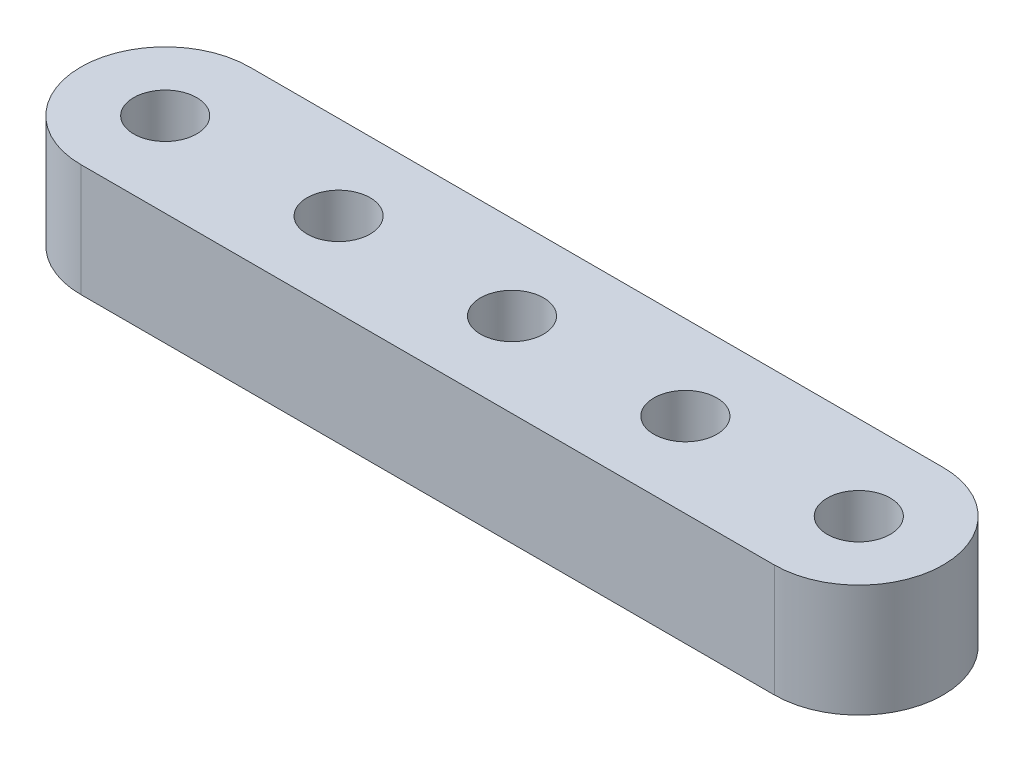
ISO-10303-21;
HEADER;
FILE_DESCRIPTION(('STEP AP214'),'2;1');
FILE_NAME('part.step','',(''),(''),'','','');
FILE_SCHEMA(('AUTOMOTIVE_DESIGN { 1 0 10303 214 1 1 1 1 }'));
ENDSEC;
DATA;
#1=APPLICATION_CONTEXT('core data for automotive mechanical design processes');
#2=APPLICATION_PROTOCOL_DEFINITION('international standard','automotive_design',2000,#1);
#3=PRODUCT_CONTEXT('',#1,'mechanical');
#4=PRODUCT('Part','Part','',(#3));
#5=PRODUCT_RELATED_PRODUCT_CATEGORY('part','',(#4));
#6=PRODUCT_DEFINITION_FORMATION('','',#4);
#7=PRODUCT_DEFINITION_CONTEXT('part definition',#1,'design');
#8=PRODUCT_DEFINITION('design','',#6,#7);
#9=PRODUCT_DEFINITION_SHAPE('','',#8);
#10=(LENGTH_UNIT() NAMED_UNIT(*) SI_UNIT(.MILLI.,.METRE.));
#11=(NAMED_UNIT(*) PLANE_ANGLE_UNIT() SI_UNIT($,.RADIAN.));
#12=(NAMED_UNIT(*) SI_UNIT($,.STERADIAN.) SOLID_ANGLE_UNIT());
#13=UNCERTAINTY_MEASURE_WITH_UNIT(LENGTH_MEASURE(1.E-05),#10,'distance_accuracy_value','');
#14=(GEOMETRIC_REPRESENTATION_CONTEXT(3) GLOBAL_UNCERTAINTY_ASSIGNED_CONTEXT((#13)) GLOBAL_UNIT_ASSIGNED_CONTEXT((#10,
#11,#12)) REPRESENTATION_CONTEXT('',''));
#15=CARTESIAN_POINT('',(0.,0.,0.));
#16=DIRECTION('',(0.,0.,1.));
#17=DIRECTION('',(1.,0.,0.));
#18=AXIS2_PLACEMENT_3D('',#15,#16,#17);
#19=CARTESIAN_POINT('',(19.558,0.,0.));
#20=DIRECTION('',(0.,1.,0.));
#21=DIRECTION('',(0.,0.,1.));
#22=AXIS2_PLACEMENT_3D('',#19,#20,#21);
#23=CYLINDRICAL_SURFACE('',#22,4.7625);
#24=CARTESIAN_POINT('',(19.558,6.35,0.));
#25=DIRECTION('',(0.,1.,0.));
#26=DIRECTION('',(0.,0.,1.));
#27=AXIS2_PLACEMENT_3D('',#24,#25,#26);
#28=CIRCLE('',#27,4.7625);
#29=CARTESIAN_POINT('',(19.558,6.35,4.76250000000001));
#30=VERTEX_POINT('',#29);
#31=CARTESIAN_POINT('',(19.558,6.35,-4.7625));
#32=VERTEX_POINT('',#31);
#33=EDGE_CURVE('E98',#30,#32,#28,.T.);
#34=ORIENTED_EDGE('',*,*,#33,.F.);
#35=DIRECTION('',(0.,1.,0.));
#36=VECTOR('',#35,1.);
#37=CARTESIAN_POINT('',(19.558,0.,4.76250000000001));
#38=LINE('',#37,#36);
#39=CARTESIAN_POINT('',(19.558,0.,4.76250000000001));
#40=VERTEX_POINT('',#39);
#41=EDGE_CURVE('E11',#40,#30,#38,.T.);
#42=ORIENTED_EDGE('',*,*,#41,.F.);
#43=CARTESIAN_POINT('',(19.558,0.,0.));
#44=DIRECTION('',(0.,1.,0.));
#45=DIRECTION('',(0.,0.,1.));
#46=AXIS2_PLACEMENT_3D('',#43,#44,#45);
#47=CIRCLE('',#46,4.7625);
#48=CARTESIAN_POINT('',(19.558,0.,-4.7625));
#49=VERTEX_POINT('',#48);
#50=EDGE_CURVE('E91',#40,#49,#47,.T.);
#51=ORIENTED_EDGE('',*,*,#50,.T.);
#52=DIRECTION('',(0.,1.,0.));
#53=VECTOR('',#52,1.);
#54=CARTESIAN_POINT('',(19.558,0.,-4.7625));
#55=LINE('',#54,#53);
#56=EDGE_CURVE('E36',#49,#32,#55,.T.);
#57=ORIENTED_EDGE('',*,*,#56,.T.);
#58=EDGE_LOOP('',(#34,#42,#51,#57));
#59=FACE_BOUND('',#58,.T.);
#60=ADVANCED_FACE('F33',(#59),#23,.T.);
#61=CARTESIAN_POINT('',(-19.558,0.,4.76250000000001));
#62=DIRECTION('',(0.,0.,1.));
#63=DIRECTION('',(1.,0.,0.));
#64=AXIS2_PLACEMENT_3D('',#61,#62,#63);
#65=PLANE('',#64);
#66=DIRECTION('',(1.,0.,0.));
#67=VECTOR('',#66,1.);
#68=CARTESIAN_POINT('',(-19.558,6.35,4.76250000000001));
#69=LINE('',#68,#67);
#70=CARTESIAN_POINT('',(-19.558,6.35,4.76250000000001));
#71=VERTEX_POINT('',#70);
#72=EDGE_CURVE('E93',#71,#30,#69,.T.);
#73=ORIENTED_EDGE('',*,*,#72,.F.);
#74=DIRECTION('',(0.,1.,0.));
#75=VECTOR('',#74,1.);
#76=CARTESIAN_POINT('',(-19.558,0.,4.76250000000001));
#77=LINE('',#76,#75);
#78=CARTESIAN_POINT('',(-19.558,0.,4.76250000000001));
#79=VERTEX_POINT('',#78);
#80=EDGE_CURVE('E42',#79,#71,#77,.T.);
#81=ORIENTED_EDGE('',*,*,#80,.F.);
#82=DIRECTION('',(1.,0.,0.));
#83=VECTOR('',#82,1.);
#84=CARTESIAN_POINT('',(-19.558,0.,4.76250000000001));
#85=LINE('',#84,#83);
#86=EDGE_CURVE('E88',#79,#40,#85,.T.);
#87=ORIENTED_EDGE('',*,*,#86,.T.);
#88=ORIENTED_EDGE('',*,*,#41,.T.);
#89=EDGE_LOOP('',(#73,#81,#87,#88));
#90=FACE_BOUND('',#89,.T.);
#91=ADVANCED_FACE('F109',(#90),#65,.T.);
#92=CARTESIAN_POINT('',(-19.558,0.,0.));
#93=DIRECTION('',(0.,1.,0.));
#94=DIRECTION('',(0.,0.,1.));
#95=AXIS2_PLACEMENT_3D('',#92,#93,#94);
#96=CYLINDRICAL_SURFACE('',#95,4.7625);
#97=CARTESIAN_POINT('',(-19.558,6.35,0.));
#98=DIRECTION('',(0.,1.,0.));
#99=DIRECTION('',(0.,0.,1.));
#100=AXIS2_PLACEMENT_3D('',#97,#98,#99);
#101=CIRCLE('',#100,4.7625);
#102=CARTESIAN_POINT('',(-19.558,6.35,-4.7625));
#103=VERTEX_POINT('',#102);
#104=EDGE_CURVE('E83',#103,#71,#101,.T.);
#105=ORIENTED_EDGE('',*,*,#104,.F.);
#106=DIRECTION('',(0.,1.,0.));
#107=VECTOR('',#106,1.);
#108=CARTESIAN_POINT('',(-19.558,0.,-4.7625));
#109=LINE('',#108,#107);
#110=CARTESIAN_POINT('',(-19.558,0.,-4.7625));
#111=VERTEX_POINT('',#110);
#112=EDGE_CURVE('E78',#111,#103,#109,.T.);
#113=ORIENTED_EDGE('',*,*,#112,.F.);
#114=CARTESIAN_POINT('',(-19.558,0.,0.));
#115=DIRECTION('',(0.,1.,0.));
#116=DIRECTION('',(0.,0.,1.));
#117=AXIS2_PLACEMENT_3D('',#114,#115,#116);
#118=CIRCLE('',#117,4.7625);
#119=EDGE_CURVE('E81',#111,#79,#118,.T.);
#120=ORIENTED_EDGE('',*,*,#119,.T.);
#121=ORIENTED_EDGE('',*,*,#80,.T.);
#122=EDGE_LOOP('',(#105,#113,#120,#121));
#123=FACE_BOUND('',#122,.T.);
#124=ADVANCED_FACE('F80',(#123),#96,.T.);
#125=CARTESIAN_POINT('',(19.558,0.,-4.7625));
#126=DIRECTION('',(0.,0.,-1.));
#127=DIRECTION('',(-1.,0.,0.));
#128=AXIS2_PLACEMENT_3D('',#125,#126,#127);
#129=PLANE('',#128);
#130=DIRECTION('',(-1.,0.,0.));
#131=VECTOR('',#130,1.);
#132=CARTESIAN_POINT('',(19.558,6.35,-4.7625));
#133=LINE('',#132,#131);
#134=EDGE_CURVE('E101',#32,#103,#133,.T.);
#135=ORIENTED_EDGE('',*,*,#134,.F.);
#136=ORIENTED_EDGE('',*,*,#56,.F.);
#137=DIRECTION('',(-1.,0.,0.));
#138=VECTOR('',#137,1.);
#139=CARTESIAN_POINT('',(19.558,0.,-4.7625));
#140=LINE('',#139,#138);
#141=EDGE_CURVE('E87',#49,#111,#140,.T.);
#142=ORIENTED_EDGE('',*,*,#141,.T.);
#143=ORIENTED_EDGE('',*,*,#112,.T.);
#144=EDGE_LOOP('',(#135,#136,#142,#143));
#145=FACE_BOUND('',#144,.T.);
#146=ADVANCED_FACE('F90',(#145),#129,.T.);
#147=CARTESIAN_POINT('',(19.558,0.,0.));
#148=DIRECTION('',(0.,1.,0.));
#149=DIRECTION('',(0.,0.,1.));
#150=AXIS2_PLACEMENT_3D('',#147,#148,#149);
#151=PLANE('',#150);
#152=CARTESIAN_POINT('',(-19.558,0.,0.));
#153=DIRECTION('',(0.,1.,0.));
#154=DIRECTION('',(0.,0.,-1.));
#155=AXIS2_PLACEMENT_3D('',#152,#153,#154);
#156=CIRCLE('',#155,1.77799999999998);
#157=CARTESIAN_POINT('',(-19.558,0.,-1.77799999999998));
#158=VERTEX_POINT('',#157);
#159=EDGE_CURVE('E154',#158,#158,#156,.T.);
#160=ORIENTED_EDGE('',*,*,#159,.T.);
#161=EDGE_LOOP('',(#160));
#162=FACE_BOUND('',#161,.T.);
#163=CARTESIAN_POINT('',(-9.779,0.,0.));
#164=DIRECTION('',(0.,1.,0.));
#165=DIRECTION('',(0.,0.,-1.));
#166=AXIS2_PLACEMENT_3D('',#163,#164,#165);
#167=CIRCLE('',#166,1.77799999999999);
#168=CARTESIAN_POINT('',(-9.779,0.,-1.77799999999999));
#169=VERTEX_POINT('',#168);
#170=EDGE_CURVE('E162',#169,#169,#167,.T.);
#171=ORIENTED_EDGE('',*,*,#170,.T.);
#172=EDGE_LOOP('',(#171));
#173=FACE_BOUND('',#172,.T.);
#174=CARTESIAN_POINT('',(0.,0.,0.));
#175=DIRECTION('',(0.,1.,0.));
#176=DIRECTION('',(0.,0.,-1.));
#177=AXIS2_PLACEMENT_3D('',#174,#175,#176);
#178=CIRCLE('',#177,1.77799999999999);
#179=CARTESIAN_POINT('',(0.,0.,-1.77799999999999));
#180=VERTEX_POINT('',#179);
#181=EDGE_CURVE('E168',#180,#180,#178,.T.);
#182=ORIENTED_EDGE('',*,*,#181,.T.);
#183=EDGE_LOOP('',(#182));
#184=FACE_BOUND('',#183,.T.);
#185=CARTESIAN_POINT('',(9.779,0.,0.));
#186=DIRECTION('',(0.,1.,0.));
#187=DIRECTION('',(0.,0.,-1.));
#188=AXIS2_PLACEMENT_3D('',#185,#186,#187);
#189=CIRCLE('',#188,1.77799999999999);
#190=CARTESIAN_POINT('',(9.779,0.,-1.77799999999998));
#191=VERTEX_POINT('',#190);
#192=EDGE_CURVE('E174',#191,#191,#189,.T.);
#193=ORIENTED_EDGE('',*,*,#192,.T.);
#194=EDGE_LOOP('',(#193));
#195=FACE_BOUND('',#194,.T.);
#196=CARTESIAN_POINT('',(19.558,0.,0.));
#197=DIRECTION('',(0.,1.,0.));
#198=DIRECTION('',(0.,0.,-1.));
#199=AXIS2_PLACEMENT_3D('',#196,#197,#198);
#200=CIRCLE('',#199,1.77799999999999);
#201=CARTESIAN_POINT('',(19.558,0.,-1.77799999999998));
#202=VERTEX_POINT('',#201);
#203=EDGE_CURVE('E102',#202,#202,#200,.T.);
#204=ORIENTED_EDGE('',*,*,#203,.T.);
#205=EDGE_LOOP('',(#204));
#206=FACE_BOUND('',#205,.T.);
#207=ORIENTED_EDGE('',*,*,#50,.F.);
#208=ORIENTED_EDGE('',*,*,#86,.F.);
#209=ORIENTED_EDGE('',*,*,#119,.F.);
#210=ORIENTED_EDGE('',*,*,#141,.F.);
#211=EDGE_LOOP('',(#207,#208,#209,#210));
#212=FACE_BOUND('',#211,.T.);
#213=ADVANCED_FACE('F86',(#162,#173,#184,#195,#206,#212),#151,.F.);
#214=CARTESIAN_POINT('',(19.558,6.35,0.));
#215=DIRECTION('',(0.,1.,0.));
#216=DIRECTION('',(0.,0.,1.));
#217=AXIS2_PLACEMENT_3D('',#214,#215,#216);
#218=PLANE('',#217);
#219=CARTESIAN_POINT('',(-19.558,6.35,0.));
#220=DIRECTION('',(0.,1.,0.));
#221=DIRECTION('',(0.,0.,-1.));
#222=AXIS2_PLACEMENT_3D('',#219,#220,#221);
#223=CIRCLE('',#222,1.77799999999998);
#224=CARTESIAN_POINT('',(-19.558,6.35,-1.77799999999998));
#225=VERTEX_POINT('',#224);
#226=EDGE_CURVE('E157',#225,#225,#223,.T.);
#227=ORIENTED_EDGE('',*,*,#226,.F.);
#228=EDGE_LOOP('',(#227));
#229=FACE_BOUND('',#228,.T.);
#230=CARTESIAN_POINT('',(-9.779,6.35,0.));
#231=DIRECTION('',(0.,1.,0.));
#232=DIRECTION('',(0.,0.,-1.));
#233=AXIS2_PLACEMENT_3D('',#230,#231,#232);
#234=CIRCLE('',#233,1.77799999999999);
#235=CARTESIAN_POINT('',(-9.779,6.35,-1.77799999999999));
#236=VERTEX_POINT('',#235);
#237=EDGE_CURVE('E159',#236,#236,#234,.T.);
#238=ORIENTED_EDGE('',*,*,#237,.F.);
#239=EDGE_LOOP('',(#238));
#240=FACE_BOUND('',#239,.T.);
#241=CARTESIAN_POINT('',(0.,6.35,0.));
#242=DIRECTION('',(0.,1.,0.));
#243=DIRECTION('',(0.,0.,-1.));
#244=AXIS2_PLACEMENT_3D('',#241,#242,#243);
#245=CIRCLE('',#244,1.77799999999999);
#246=CARTESIAN_POINT('',(0.,6.35,-1.77799999999999));
#247=VERTEX_POINT('',#246);
#248=EDGE_CURVE('E165',#247,#247,#245,.T.);
#249=ORIENTED_EDGE('',*,*,#248,.F.);
#250=EDGE_LOOP('',(#249));
#251=FACE_BOUND('',#250,.T.);
#252=CARTESIAN_POINT('',(9.779,6.35,0.));
#253=DIRECTION('',(0.,1.,0.));
#254=DIRECTION('',(0.,0.,-1.));
#255=AXIS2_PLACEMENT_3D('',#252,#253,#254);
#256=CIRCLE('',#255,1.77799999999999);
#257=CARTESIAN_POINT('',(9.779,6.35,-1.77799999999998));
#258=VERTEX_POINT('',#257);
#259=EDGE_CURVE('E171',#258,#258,#256,.T.);
#260=ORIENTED_EDGE('',*,*,#259,.F.);
#261=EDGE_LOOP('',(#260));
#262=FACE_BOUND('',#261,.T.);
#263=CARTESIAN_POINT('',(19.558,6.35,0.));
#264=DIRECTION('',(0.,1.,0.));
#265=DIRECTION('',(0.,0.,-1.));
#266=AXIS2_PLACEMENT_3D('',#263,#264,#265);
#267=CIRCLE('',#266,1.77799999999999);
#268=CARTESIAN_POINT('',(19.558,6.35,-1.77799999999998));
#269=VERTEX_POINT('',#268);
#270=EDGE_CURVE('E177',#269,#269,#267,.T.);
#271=ORIENTED_EDGE('',*,*,#270,.F.);
#272=EDGE_LOOP('',(#271));
#273=FACE_BOUND('',#272,.T.);
#274=ORIENTED_EDGE('',*,*,#33,.T.);
#275=ORIENTED_EDGE('',*,*,#134,.T.);
#276=ORIENTED_EDGE('',*,*,#104,.T.);
#277=ORIENTED_EDGE('',*,*,#72,.T.);
#278=EDGE_LOOP('',(#274,#275,#276,#277));
#279=FACE_BOUND('',#278,.T.);
#280=ADVANCED_FACE('F108',(#229,#240,#251,#262,#273,#279),#218,.T.);
#281=CARTESIAN_POINT('',(19.558,0.,0.));
#282=DIRECTION('',(0.,1.,0.));
#283=DIRECTION('',(0.,0.,1.));
#284=AXIS2_PLACEMENT_3D('',#281,#282,#283);
#285=CYLINDRICAL_SURFACE('',#284,1.77799999999999);
#286=ORIENTED_EDGE('',*,*,#203,.F.);
#287=EDGE_LOOP('',(#286));
#288=FACE_BOUND('',#287,.T.);
#289=ORIENTED_EDGE('',*,*,#270,.T.);
#290=EDGE_LOOP('',(#289));
#291=FACE_BOUND('',#290,.T.);
#292=ADVANCED_FACE('F127',(#288,#291),#285,.F.);
#293=CARTESIAN_POINT('',(9.779,0.,0.));
#294=DIRECTION('',(0.,1.,0.));
#295=DIRECTION('',(0.,0.,1.));
#296=AXIS2_PLACEMENT_3D('',#293,#294,#295);
#297=CYLINDRICAL_SURFACE('',#296,1.77799999999999);
#298=ORIENTED_EDGE('',*,*,#192,.F.);
#299=EDGE_LOOP('',(#298));
#300=FACE_BOUND('',#299,.T.);
#301=ORIENTED_EDGE('',*,*,#259,.T.);
#302=EDGE_LOOP('',(#301));
#303=FACE_BOUND('',#302,.T.);
#304=ADVANCED_FACE('F134',(#300,#303),#297,.F.);
#305=CARTESIAN_POINT('',(0.,0.,0.));
#306=DIRECTION('',(0.,1.,0.));
#307=DIRECTION('',(0.,0.,1.));
#308=AXIS2_PLACEMENT_3D('',#305,#306,#307);
#309=CYLINDRICAL_SURFACE('',#308,1.77799999999999);
#310=ORIENTED_EDGE('',*,*,#181,.F.);
#311=EDGE_LOOP('',(#310));
#312=FACE_BOUND('',#311,.T.);
#313=ORIENTED_EDGE('',*,*,#248,.T.);
#314=EDGE_LOOP('',(#313));
#315=FACE_BOUND('',#314,.T.);
#316=ADVANCED_FACE('F138',(#312,#315),#309,.F.);
#317=CARTESIAN_POINT('',(-9.779,0.,0.));
#318=DIRECTION('',(0.,1.,0.));
#319=DIRECTION('',(0.,0.,1.));
#320=AXIS2_PLACEMENT_3D('',#317,#318,#319);
#321=CYLINDRICAL_SURFACE('',#320,1.77799999999999);
#322=ORIENTED_EDGE('',*,*,#170,.F.);
#323=EDGE_LOOP('',(#322));
#324=FACE_BOUND('',#323,.T.);
#325=ORIENTED_EDGE('',*,*,#237,.T.);
#326=EDGE_LOOP('',(#325));
#327=FACE_BOUND('',#326,.T.);
#328=ADVANCED_FACE('F142',(#324,#327),#321,.F.);
#329=CARTESIAN_POINT('',(-19.558,0.,0.));
#330=DIRECTION('',(0.,1.,0.));
#331=DIRECTION('',(0.,0.,1.));
#332=AXIS2_PLACEMENT_3D('',#329,#330,#331);
#333=CYLINDRICAL_SURFACE('',#332,1.77799999999998);
#334=ORIENTED_EDGE('',*,*,#159,.F.);
#335=EDGE_LOOP('',(#334));
#336=FACE_BOUND('',#335,.T.);
#337=ORIENTED_EDGE('',*,*,#226,.T.);
#338=EDGE_LOOP('',(#337));
#339=FACE_BOUND('',#338,.T.);
#340=ADVANCED_FACE('F146',(#336,#339),#333,.F.);
#341=CLOSED_SHELL('',(#60,#91,#124,#146,#213,#280,#292,#304,#316,#328,#340));
#342=MANIFOLD_SOLID_BREP('B2',#341);
#343=ADVANCED_BREP_SHAPE_REPRESENTATION('',(#18,#342),#14);
#344=SHAPE_DEFINITION_REPRESENTATION(#9,#343);
ENDSEC;
END-ISO-10303-21;
